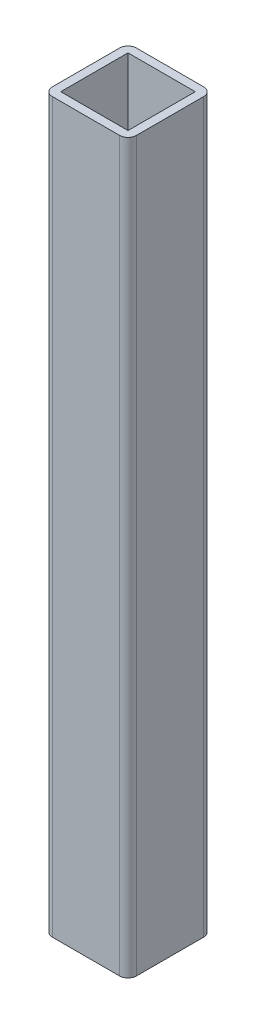
ISO-10303-21;
HEADER;
FILE_DESCRIPTION(('STEP AP214'),'2;1');
FILE_NAME('part.step','',(''),(''),'','','');
FILE_SCHEMA(('AUTOMOTIVE_DESIGN { 1 0 10303 214 1 1 1 1 }'));
ENDSEC;
DATA;
#1=APPLICATION_CONTEXT('core data for automotive mechanical design processes');
#2=APPLICATION_PROTOCOL_DEFINITION('international standard','automotive_design',2000,#1);
#3=PRODUCT_CONTEXT('',#1,'mechanical');
#4=PRODUCT('Part','Part','',(#3));
#5=PRODUCT_RELATED_PRODUCT_CATEGORY('part','',(#4));
#6=PRODUCT_DEFINITION_FORMATION('','',#4);
#7=PRODUCT_DEFINITION_CONTEXT('part definition',#1,'design');
#8=PRODUCT_DEFINITION('design','',#6,#7);
#9=PRODUCT_DEFINITION_SHAPE('','',#8);
#10=(LENGTH_UNIT() NAMED_UNIT(*) SI_UNIT(.MILLI.,.METRE.));
#11=(NAMED_UNIT(*) PLANE_ANGLE_UNIT() SI_UNIT($,.RADIAN.));
#12=(NAMED_UNIT(*) SI_UNIT($,.STERADIAN.) SOLID_ANGLE_UNIT());
#13=UNCERTAINTY_MEASURE_WITH_UNIT(LENGTH_MEASURE(1.E-05),#10,'distance_accuracy_value','');
#14=(GEOMETRIC_REPRESENTATION_CONTEXT(3) GLOBAL_UNCERTAINTY_ASSIGNED_CONTEXT((#13)) GLOBAL_UNIT_ASSIGNED_CONTEXT((#10,
#11,#12)) REPRESENTATION_CONTEXT('',''));
#15=CARTESIAN_POINT('',(0.,0.,0.));
#16=DIRECTION('',(0.,0.,1.));
#17=DIRECTION('',(1.,0.,0.));
#18=AXIS2_PLACEMENT_3D('',#15,#16,#17);
#19=CARTESIAN_POINT('',(-15.,640.,-80.1201374153035));
#20=DIRECTION('',(0.,0.,-1.));
#21=DIRECTION('',(-1.,0.,0.));
#22=AXIS2_PLACEMENT_3D('',#19,#20,#21);
#23=PLANE('',#22);
#24=DIRECTION('',(0.,-1.,0.));
#25=VECTOR('',#24,1.);
#26=CARTESIAN_POINT('',(12.,640.,-80.1201374153035));
#27=LINE('',#26,#25);
#28=CARTESIAN_POINT('',(12.,387.934536743125,-80.1201374153035));
#29=VERTEX_POINT('',#28);
#30=CARTESIAN_POINT('',(12.,647.649993896484,-80.1201374153035));
#31=VERTEX_POINT('',#30);
#32=EDGE_CURVE('E95',#29,#31,#27,.F.);
#33=ORIENTED_EDGE('',*,*,#32,.F.);
#34=DIRECTION('',(1.,0.,0.));
#35=VECTOR('',#34,1.);
#36=CARTESIAN_POINT('',(-2.71782596428238E-12,387.934536743125,-80.1201374153035));
#37=LINE('',#36,#35);
#38=CARTESIAN_POINT('',(-12.,387.934536743125,-80.1201374153035));
#39=VERTEX_POINT('',#38);
#40=EDGE_CURVE('E176',#39,#29,#37,.T.);
#41=ORIENTED_EDGE('',*,*,#40,.F.);
#42=DIRECTION('',(0.,-1.,0.));
#43=VECTOR('',#42,1.);
#44=CARTESIAN_POINT('',(-12.,640.,-80.1201374153035));
#45=LINE('',#44,#43);
#46=CARTESIAN_POINT('',(-12.,647.649993896484,-80.1201374153035));
#47=VERTEX_POINT('',#46);
#48=EDGE_CURVE('E125',#47,#39,#45,.T.);
#49=ORIENTED_EDGE('',*,*,#48,.F.);
#50=DIRECTION('',(1.,0.,0.));
#51=VECTOR('',#50,1.);
#52=CARTESIAN_POINT('',(-2.71782596428238E-12,647.649993896484,-80.1201374153035));
#53=LINE('',#52,#51);
#54=EDGE_CURVE('E84',#47,#31,#53,.T.);
#55=ORIENTED_EDGE('',*,*,#54,.T.);
#56=EDGE_LOOP('',(#33,#41,#49,#55));
#57=FACE_BOUND('',#56,.T.);
#58=ADVANCED_FACE('F17',(#57),#23,.T.);
#59=CARTESIAN_POINT('',(12.,640.,-77.1201374153035));
#60=DIRECTION('',(0.,-1.,0.));
#61=DIRECTION('',(0.,0.,-1.));
#62=AXIS2_PLACEMENT_3D('',#59,#60,#61);
#63=CYLINDRICAL_SURFACE('',#62,3.);
#64=CARTESIAN_POINT('',(12.,647.649993896484,-77.1201374153035));
#65=DIRECTION('',(0.,-1.,0.));
#66=DIRECTION('',(0.,0.,-1.));
#67=AXIS2_PLACEMENT_3D('',#64,#65,#66);
#68=CIRCLE('',#67,3.);
#69=CARTESIAN_POINT('',(15.,647.649993896484,-77.1201374153035));
#70=VERTEX_POINT('',#69);
#71=EDGE_CURVE('E20',#31,#70,#68,.T.);
#72=ORIENTED_EDGE('',*,*,#71,.T.);
#73=DIRECTION('',(0.,1.,0.));
#74=VECTOR('',#73,1.);
#75=CARTESIAN_POINT('',(15.,640.,-77.1201374153035));
#76=LINE('',#75,#74);
#77=CARTESIAN_POINT('',(15.,387.934536743125,-77.1201374153035));
#78=VERTEX_POINT('',#77);
#79=EDGE_CURVE('E93',#78,#70,#76,.T.);
#80=ORIENTED_EDGE('',*,*,#79,.F.);
#81=CARTESIAN_POINT('',(12.,387.934536743125,-77.1201374153035));
#82=DIRECTION('',(0.,-1.,0.));
#83=DIRECTION('',(0.,0.,-1.));
#84=AXIS2_PLACEMENT_3D('',#81,#82,#83);
#85=CIRCLE('',#84,3.);
#86=EDGE_CURVE('E174',#29,#78,#85,.T.);
#87=ORIENTED_EDGE('',*,*,#86,.F.);
#88=ORIENTED_EDGE('',*,*,#32,.T.);
#89=EDGE_LOOP('',(#72,#80,#87,#88));
#90=FACE_BOUND('',#89,.T.);
#91=ADVANCED_FACE('F91',(#90),#63,.T.);
#92=CARTESIAN_POINT('',(15.,640.,-80.1201374153035));
#93=DIRECTION('',(1.,0.,0.));
#94=DIRECTION('',(0.,0.,-1.));
#95=AXIS2_PLACEMENT_3D('',#92,#93,#94);
#96=PLANE('',#95);
#97=DIRECTION('',(0.,-1.,0.));
#98=VECTOR('',#97,1.);
#99=CARTESIAN_POINT('',(15.,640.,-53.1201374153035));
#100=LINE('',#99,#98);
#101=CARTESIAN_POINT('',(15.,387.934536743125,-53.1201374153035));
#102=VERTEX_POINT('',#101);
#103=CARTESIAN_POINT('',(15.,647.649993896484,-53.1201374153035));
#104=VERTEX_POINT('',#103);
#105=EDGE_CURVE('E106',#102,#104,#100,.F.);
#106=ORIENTED_EDGE('',*,*,#105,.F.);
#107=DIRECTION('',(0.,0.,-1.));
#108=VECTOR('',#107,1.);
#109=CARTESIAN_POINT('',(15.,387.934536743125,-45.5800237534903));
#110=LINE('',#109,#108);
#111=EDGE_CURVE('E104',#78,#102,#110,.F.);
#112=ORIENTED_EDGE('',*,*,#111,.F.);
#113=ORIENTED_EDGE('',*,*,#79,.T.);
#114=DIRECTION('',(0.,0.,-1.));
#115=VECTOR('',#114,1.);
#116=CARTESIAN_POINT('',(15.,647.649993896484,-45.5800237534903));
#117=LINE('',#116,#115);
#118=EDGE_CURVE('E98',#70,#104,#117,.F.);
#119=ORIENTED_EDGE('',*,*,#118,.T.);
#120=EDGE_LOOP('',(#106,#112,#113,#119));
#121=FACE_BOUND('',#120,.T.);
#122=ADVANCED_FACE('F101',(#121),#96,.T.);
#123=CARTESIAN_POINT('',(12.,640.,-53.1201374153035));
#124=DIRECTION('',(0.,-1.,0.));
#125=DIRECTION('',(0.,0.,-1.));
#126=AXIS2_PLACEMENT_3D('',#123,#124,#125);
#127=CYLINDRICAL_SURFACE('',#126,3.);
#128=CARTESIAN_POINT('',(12.,647.649993896484,-53.1201374153035));
#129=DIRECTION('',(0.,-1.,0.));
#130=DIRECTION('',(0.,0.,-1.));
#131=AXIS2_PLACEMENT_3D('',#128,#129,#130);
#132=CIRCLE('',#131,3.);
#133=CARTESIAN_POINT('',(12.,647.649993896484,-50.1201374153035));
#134=VERTEX_POINT('',#133);
#135=EDGE_CURVE('E111',#104,#134,#132,.T.);
#136=ORIENTED_EDGE('',*,*,#135,.T.);
#137=DIRECTION('',(0.,1.,0.));
#138=VECTOR('',#137,1.);
#139=CARTESIAN_POINT('',(12.,640.,-50.1201374153035));
#140=LINE('',#139,#138);
#141=CARTESIAN_POINT('',(12.,387.934536743125,-50.1201374153035));
#142=VERTEX_POINT('',#141);
#143=EDGE_CURVE('E119',#142,#134,#140,.T.);
#144=ORIENTED_EDGE('',*,*,#143,.F.);
#145=CARTESIAN_POINT('',(12.,387.934536743125,-53.1201374153035));
#146=DIRECTION('',(0.,-1.,0.));
#147=DIRECTION('',(0.,0.,-1.));
#148=AXIS2_PLACEMENT_3D('',#145,#146,#147);
#149=CIRCLE('',#148,3.);
#150=EDGE_CURVE('E171',#102,#142,#149,.T.);
#151=ORIENTED_EDGE('',*,*,#150,.F.);
#152=ORIENTED_EDGE('',*,*,#105,.T.);
#153=EDGE_LOOP('',(#136,#144,#151,#152));
#154=FACE_BOUND('',#153,.T.);
#155=ADVANCED_FACE('F321',(#154),#127,.T.);
#156=CARTESIAN_POINT('',(15.,640.,-50.1201374153035));
#157=DIRECTION('',(0.,0.,1.));
#158=DIRECTION('',(1.,0.,0.));
#159=AXIS2_PLACEMENT_3D('',#156,#157,#158);
#160=PLANE('',#159);
#161=ORIENTED_EDGE('',*,*,#143,.T.);
#162=DIRECTION('',(1.,0.,0.));
#163=VECTOR('',#162,1.);
#164=CARTESIAN_POINT('',(-2.71782596428238E-12,647.649993896484,-50.1201374153035));
#165=LINE('',#164,#163);
#166=CARTESIAN_POINT('',(-12.,647.649993896484,-50.1201374153035));
#167=VERTEX_POINT('',#166);
#168=EDGE_CURVE('E113',#134,#167,#165,.F.);
#169=ORIENTED_EDGE('',*,*,#168,.T.);
#170=DIRECTION('',(0.,-1.,0.));
#171=VECTOR('',#170,1.);
#172=CARTESIAN_POINT('',(-12.,640.,-50.1201374153035));
#173=LINE('',#172,#171);
#174=CARTESIAN_POINT('',(-12.,387.934536743125,-50.1201374153035));
#175=VERTEX_POINT('',#174);
#176=EDGE_CURVE('E118',#175,#167,#173,.F.);
#177=ORIENTED_EDGE('',*,*,#176,.F.);
#178=DIRECTION('',(1.,0.,0.));
#179=VECTOR('',#178,1.);
#180=CARTESIAN_POINT('',(-2.71782596428238E-12,387.934536743125,-50.1201374153035));
#181=LINE('',#180,#179);
#182=EDGE_CURVE('E164',#142,#175,#181,.F.);
#183=ORIENTED_EDGE('',*,*,#182,.F.);
#184=EDGE_LOOP('',(#161,#169,#177,#183));
#185=FACE_BOUND('',#184,.T.);
#186=ADVANCED_FACE('F197',(#185),#160,.T.);
#187=CARTESIAN_POINT('',(12.,387.934536743125,-53.1201374153035));
#188=DIRECTION('',(1.,0.,0.));
#189=DIRECTION('',(0.,0.,-1.));
#190=AXIS2_PLACEMENT_3D('',#187,#188,#189);
#191=PLANE('',#190);
#192=DIRECTION('',(0.,1.,0.));
#193=VECTOR('',#192,1.);
#194=CARTESIAN_POINT('',(12.,387.934536743125,-53.1201374153035));
#195=LINE('',#194,#193);
#196=CARTESIAN_POINT('',(12.,387.934536743125,-53.1201374153035));
#197=VERTEX_POINT('',#196);
#198=CARTESIAN_POINT('',(12.,647.649993896484,-53.1201374153035));
#199=VERTEX_POINT('',#198);
#200=EDGE_CURVE('E132',#197,#199,#195,.T.);
#201=ORIENTED_EDGE('',*,*,#200,.T.);
#202=DIRECTION('',(0.,0.,-1.));
#203=VECTOR('',#202,1.);
#204=CARTESIAN_POINT('',(12.,647.649993896484,-53.1201374153035));
#205=LINE('',#204,#203);
#206=CARTESIAN_POINT('',(12.,647.649993896484,-77.1201374153035));
#207=VERTEX_POINT('',#206);
#208=EDGE_CURVE('E182',#199,#207,#205,.T.);
#209=ORIENTED_EDGE('',*,*,#208,.T.);
#210=DIRECTION('',(0.,1.,0.));
#211=VECTOR('',#210,1.);
#212=CARTESIAN_POINT('',(12.,387.934536743125,-77.1201374153035));
#213=LINE('',#212,#211);
#214=CARTESIAN_POINT('',(12.,387.934536743125,-77.1201374153035));
#215=VERTEX_POINT('',#214);
#216=EDGE_CURVE('E122',#207,#215,#213,.F.);
#217=ORIENTED_EDGE('',*,*,#216,.T.);
#218=DIRECTION('',(0.,0.,-1.));
#219=VECTOR('',#218,1.);
#220=CARTESIAN_POINT('',(12.,387.934536743125,-45.5800237534903));
#221=LINE('',#220,#219);
#222=EDGE_CURVE('E161',#197,#215,#221,.T.);
#223=ORIENTED_EDGE('',*,*,#222,.F.);
#224=EDGE_LOOP('',(#201,#209,#217,#223));
#225=FACE_BOUND('',#224,.T.);
#226=ADVANCED_FACE('F302',(#225),#191,.F.);
#227=CARTESIAN_POINT('',(12.,387.934536743125,-77.1201374153035));
#228=DIRECTION('',(0.,0.,-1.));
#229=DIRECTION('',(-1.,0.,0.));
#230=AXIS2_PLACEMENT_3D('',#227,#228,#229);
#231=PLANE('',#230);
#232=ORIENTED_EDGE('',*,*,#216,.F.);
#233=DIRECTION('',(-1.,0.,0.));
#234=VECTOR('',#233,1.);
#235=CARTESIAN_POINT('',(12.,647.649993896484,-77.1201374153035));
#236=LINE('',#235,#234);
#237=CARTESIAN_POINT('',(-12.,647.649993896484,-77.1201374153035));
#238=VERTEX_POINT('',#237);
#239=EDGE_CURVE('E190',#207,#238,#236,.T.);
#240=ORIENTED_EDGE('',*,*,#239,.T.);
#241=DIRECTION('',(0.,1.,0.));
#242=VECTOR('',#241,1.);
#243=CARTESIAN_POINT('',(-12.,387.934536743125,-77.1201374153035));
#244=LINE('',#243,#242);
#245=CARTESIAN_POINT('',(-12.,387.934536743125,-77.1201374153035));
#246=VERTEX_POINT('',#245);
#247=EDGE_CURVE('E134',#238,#246,#244,.F.);
#248=ORIENTED_EDGE('',*,*,#247,.T.);
#249=DIRECTION('',(1.,0.,0.));
#250=VECTOR('',#249,1.);
#251=CARTESIAN_POINT('',(-2.71782596428238E-12,387.934536743125,-77.1201374153035));
#252=LINE('',#251,#250);
#253=EDGE_CURVE('E158',#215,#246,#252,.F.);
#254=ORIENTED_EDGE('',*,*,#253,.F.);
#255=EDGE_LOOP('',(#232,#240,#248,#254));
#256=FACE_BOUND('',#255,.T.);
#257=ADVANCED_FACE('F292',(#256),#231,.F.);
#258=CARTESIAN_POINT('',(-12.,387.934536743125,-77.1201374153035));
#259=DIRECTION('',(-1.,0.,0.));
#260=DIRECTION('',(0.,0.,1.));
#261=AXIS2_PLACEMENT_3D('',#258,#259,#260);
#262=PLANE('',#261);
#263=ORIENTED_EDGE('',*,*,#247,.F.);
#264=DIRECTION('',(0.,0.,1.));
#265=VECTOR('',#264,1.);
#266=CARTESIAN_POINT('',(-12.,647.649993896484,-77.1201374153035));
#267=LINE('',#266,#265);
#268=CARTESIAN_POINT('',(-12.,647.649993896484,-53.1201374153035));
#269=VERTEX_POINT('',#268);
#270=EDGE_CURVE('E188',#238,#269,#267,.T.);
#271=ORIENTED_EDGE('',*,*,#270,.T.);
#272=DIRECTION('',(0.,1.,0.));
#273=VECTOR('',#272,1.);
#274=CARTESIAN_POINT('',(-12.,387.934536743125,-53.1201374153035));
#275=LINE('',#274,#273);
#276=CARTESIAN_POINT('',(-12.,387.934536743125,-53.1201374153035));
#277=VERTEX_POINT('',#276);
#278=EDGE_CURVE('E131',#269,#277,#275,.F.);
#279=ORIENTED_EDGE('',*,*,#278,.T.);
#280=DIRECTION('',(0.,0.,-1.));
#281=VECTOR('',#280,1.);
#282=CARTESIAN_POINT('',(-12.,387.934536743125,-45.5800237534903));
#283=LINE('',#282,#281);
#284=EDGE_CURVE('E153',#246,#277,#283,.F.);
#285=ORIENTED_EDGE('',*,*,#284,.F.);
#286=EDGE_LOOP('',(#263,#271,#279,#285));
#287=FACE_BOUND('',#286,.T.);
#288=ADVANCED_FACE('F282',(#287),#262,.F.);
#289=CARTESIAN_POINT('',(-12.,387.934536743125,-53.1201374153035));
#290=DIRECTION('',(0.,0.,1.));
#291=DIRECTION('',(1.,0.,0.));
#292=AXIS2_PLACEMENT_3D('',#289,#290,#291);
#293=PLANE('',#292);
#294=ORIENTED_EDGE('',*,*,#278,.F.);
#295=DIRECTION('',(1.,0.,0.));
#296=VECTOR('',#295,1.);
#297=CARTESIAN_POINT('',(-12.,647.649993896484,-53.1201374153035));
#298=LINE('',#297,#296);
#299=EDGE_CURVE('E185',#269,#199,#298,.T.);
#300=ORIENTED_EDGE('',*,*,#299,.T.);
#301=ORIENTED_EDGE('',*,*,#200,.F.);
#302=DIRECTION('',(1.,0.,0.));
#303=VECTOR('',#302,1.);
#304=CARTESIAN_POINT('',(-2.71782596428238E-12,387.934536743125,-53.1201374153035));
#305=LINE('',#304,#303);
#306=EDGE_CURVE('E149',#277,#197,#305,.T.);
#307=ORIENTED_EDGE('',*,*,#306,.F.);
#308=EDGE_LOOP('',(#294,#300,#301,#307));
#309=FACE_BOUND('',#308,.T.);
#310=ADVANCED_FACE('F273',(#309),#293,.F.);
#311=CARTESIAN_POINT('',(-12.,640.,-53.1201374153035));
#312=DIRECTION('',(0.,-1.,0.));
#313=DIRECTION('',(0.,0.,-1.));
#314=AXIS2_PLACEMENT_3D('',#311,#312,#313);
#315=CYLINDRICAL_SURFACE('',#314,3.);
#316=CARTESIAN_POINT('',(-12.,647.649993896484,-53.1201374153035));
#317=DIRECTION('',(0.,-1.,0.));
#318=DIRECTION('',(0.,0.,-1.));
#319=AXIS2_PLACEMENT_3D('',#316,#317,#318);
#320=CIRCLE('',#319,3.);
#321=CARTESIAN_POINT('',(-15.,647.649993896484,-53.1201374153035));
#322=VERTEX_POINT('',#321);
#323=EDGE_CURVE('E192',#167,#322,#320,.T.);
#324=ORIENTED_EDGE('',*,*,#323,.T.);
#325=DIRECTION('',(0.,1.,0.));
#326=VECTOR('',#325,1.);
#327=CARTESIAN_POINT('',(-15.,640.,-53.1201374153035));
#328=LINE('',#327,#326);
#329=CARTESIAN_POINT('',(-15.,387.934536743125,-53.1201374153035));
#330=VERTEX_POINT('',#329);
#331=EDGE_CURVE('E152',#330,#322,#328,.T.);
#332=ORIENTED_EDGE('',*,*,#331,.F.);
#333=CARTESIAN_POINT('',(-12.,387.934536743125,-53.1201374153035));
#334=DIRECTION('',(0.,-1.,0.));
#335=DIRECTION('',(0.,0.,-1.));
#336=AXIS2_PLACEMENT_3D('',#333,#334,#335);
#337=CIRCLE('',#336,3.);
#338=EDGE_CURVE('E127',#175,#330,#337,.T.);
#339=ORIENTED_EDGE('',*,*,#338,.F.);
#340=ORIENTED_EDGE('',*,*,#176,.T.);
#341=EDGE_LOOP('',(#324,#332,#339,#340));
#342=FACE_BOUND('',#341,.T.);
#343=ADVANCED_FACE('F201',(#342),#315,.T.);
#344=CARTESIAN_POINT('',(-2.71782596428238E-12,647.649993896484,-45.5800237534903));
#345=DIRECTION('',(0.,-1.,0.));
#346=DIRECTION('',(0.,0.,-1.));
#347=AXIS2_PLACEMENT_3D('',#344,#345,#346);
#348=PLANE('',#347);
#349=ORIENTED_EDGE('',*,*,#299,.F.);
#350=ORIENTED_EDGE('',*,*,#270,.F.);
#351=ORIENTED_EDGE('',*,*,#239,.F.);
#352=ORIENTED_EDGE('',*,*,#208,.F.);
#353=EDGE_LOOP('',(#349,#350,#351,#352));
#354=FACE_BOUND('',#353,.T.);
#355=ORIENTED_EDGE('',*,*,#168,.F.);
#356=ORIENTED_EDGE('',*,*,#135,.F.);
#357=ORIENTED_EDGE('',*,*,#118,.F.);
#358=ORIENTED_EDGE('',*,*,#71,.F.);
#359=ORIENTED_EDGE('',*,*,#54,.F.);
#360=CARTESIAN_POINT('',(-12.,647.649993896484,-77.1201374153035));
#361=DIRECTION('',(0.,-1.,0.));
#362=DIRECTION('',(0.,0.,-1.));
#363=AXIS2_PLACEMENT_3D('',#360,#361,#362);
#364=CIRCLE('',#363,3.);
#365=CARTESIAN_POINT('',(-15.,647.649993896484,-77.1201374153035));
#366=VERTEX_POINT('',#365);
#367=EDGE_CURVE('E128',#366,#47,#364,.T.);
#368=ORIENTED_EDGE('',*,*,#367,.F.);
#369=DIRECTION('',(0.,0.,1.));
#370=VECTOR('',#369,1.);
#371=CARTESIAN_POINT('',(-15.,647.649993896484,-50.1201374153035));
#372=LINE('',#371,#370);
#373=EDGE_CURVE('E204',#322,#366,#372,.F.);
#374=ORIENTED_EDGE('',*,*,#373,.F.);
#375=ORIENTED_EDGE('',*,*,#323,.F.);
#376=EDGE_LOOP('',(#355,#356,#357,#358,#359,#368,#374,#375));
#377=FACE_BOUND('',#376,.T.);
#378=ADVANCED_FACE('F110',(#354,#377),#348,.F.);
#379=CARTESIAN_POINT('',(-12.,640.,-77.1201374153035));
#380=DIRECTION('',(0.,-1.,0.));
#381=DIRECTION('',(0.,0.,-1.));
#382=AXIS2_PLACEMENT_3D('',#379,#380,#381);
#383=CYLINDRICAL_SURFACE('',#382,3.);
#384=ORIENTED_EDGE('',*,*,#367,.T.);
#385=ORIENTED_EDGE('',*,*,#48,.T.);
#386=CARTESIAN_POINT('',(-12.,387.934536743125,-77.1201374153035));
#387=DIRECTION('',(0.,-1.,0.));
#388=DIRECTION('',(0.,0.,-1.));
#389=AXIS2_PLACEMENT_3D('',#386,#387,#388);
#390=CIRCLE('',#389,3.);
#391=CARTESIAN_POINT('',(-15.,387.934536743125,-77.1201374153035));
#392=VERTEX_POINT('',#391);
#393=EDGE_CURVE('E35',#392,#39,#390,.T.);
#394=ORIENTED_EDGE('',*,*,#393,.F.);
#395=DIRECTION('',(0.,1.,0.));
#396=VECTOR('',#395,1.);
#397=CARTESIAN_POINT('',(-15.,640.,-77.1201374153035));
#398=LINE('',#397,#396);
#399=EDGE_CURVE('E26',#366,#392,#398,.F.);
#400=ORIENTED_EDGE('',*,*,#399,.F.);
#401=EDGE_LOOP('',(#384,#385,#394,#400));
#402=FACE_BOUND('',#401,.T.);
#403=ADVANCED_FACE('F229',(#402),#383,.T.);
#404=CARTESIAN_POINT('',(-2.71782596428238E-12,387.934536743125,-45.5800237534903));
#405=DIRECTION('',(0.,-1.,0.));
#406=DIRECTION('',(0.,0.,-1.));
#407=AXIS2_PLACEMENT_3D('',#404,#405,#406);
#408=PLANE('',#407);
#409=ORIENTED_EDGE('',*,*,#284,.T.);
#410=ORIENTED_EDGE('',*,*,#306,.T.);
#411=ORIENTED_EDGE('',*,*,#222,.T.);
#412=ORIENTED_EDGE('',*,*,#253,.T.);
#413=EDGE_LOOP('',(#409,#410,#411,#412));
#414=FACE_BOUND('',#413,.T.);
#415=ORIENTED_EDGE('',*,*,#150,.T.);
#416=ORIENTED_EDGE('',*,*,#182,.T.);
#417=ORIENTED_EDGE('',*,*,#338,.T.);
#418=DIRECTION('',(0.,0.,1.));
#419=VECTOR('',#418,1.);
#420=CARTESIAN_POINT('',(-15.,387.934536743125,-50.1201374153035));
#421=LINE('',#420,#419);
#422=EDGE_CURVE('E11',#392,#330,#421,.T.);
#423=ORIENTED_EDGE('',*,*,#422,.F.);
#424=ORIENTED_EDGE('',*,*,#393,.T.);
#425=ORIENTED_EDGE('',*,*,#40,.T.);
#426=ORIENTED_EDGE('',*,*,#86,.T.);
#427=ORIENTED_EDGE('',*,*,#111,.T.);
#428=EDGE_LOOP('',(#415,#416,#417,#423,#424,#425,#426,#427));
#429=FACE_BOUND('',#428,.T.);
#430=ADVANCED_FACE('F216',(#414,#429),#408,.T.);
#431=CARTESIAN_POINT('',(-15.,640.,-50.1201374153035));
#432=DIRECTION('',(-1.,0.,0.));
#433=DIRECTION('',(0.,0.,1.));
#434=AXIS2_PLACEMENT_3D('',#431,#432,#433);
#435=PLANE('',#434);
#436=ORIENTED_EDGE('',*,*,#399,.T.);
#437=ORIENTED_EDGE('',*,*,#422,.T.);
#438=ORIENTED_EDGE('',*,*,#331,.T.);
#439=ORIENTED_EDGE('',*,*,#373,.T.);
#440=EDGE_LOOP('',(#436,#437,#438,#439));
#441=FACE_BOUND('',#440,.T.);
#442=ADVANCED_FACE('F208',(#441),#435,.T.);
#443=CLOSED_SHELL('',(#58,#91,#122,#155,#186,#226,#257,#288,#310,#343,#378,#403,#430,#442));
#444=MANIFOLD_SOLID_BREP('B1',#443);
#445=ADVANCED_BREP_SHAPE_REPRESENTATION('',(#18,#444),#14);
#446=SHAPE_DEFINITION_REPRESENTATION(#9,#445);
ENDSEC;
END-ISO-10303-21;
